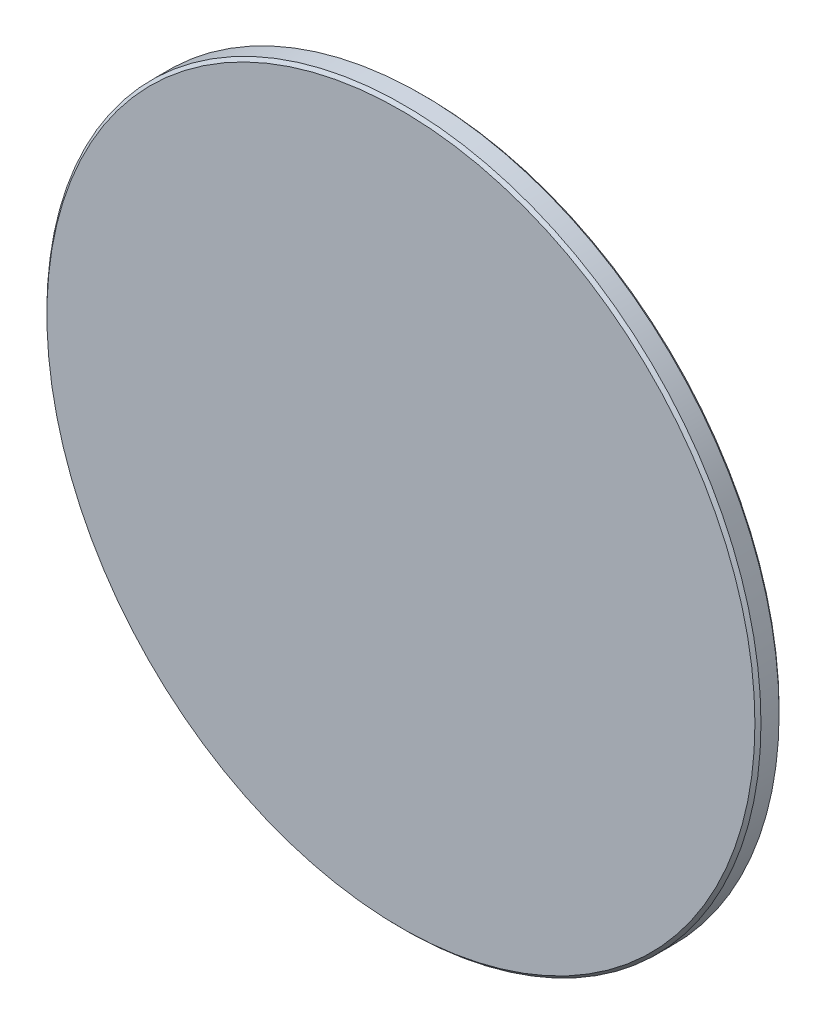
ISO-10303-21;
HEADER;
FILE_DESCRIPTION(('STEP AP214'),'2;1');
FILE_NAME('part.step','',(''),(''),'','','');
FILE_SCHEMA(('AUTOMOTIVE_DESIGN { 1 0 10303 214 1 1 1 1 }'));
ENDSEC;
DATA;
#1=APPLICATION_CONTEXT('core data for automotive mechanical design processes');
#2=APPLICATION_PROTOCOL_DEFINITION('international standard','automotive_design',2000,#1);
#3=PRODUCT_CONTEXT('',#1,'mechanical');
#4=PRODUCT('Part','Part','',(#3));
#5=PRODUCT_RELATED_PRODUCT_CATEGORY('part','',(#4));
#6=PRODUCT_DEFINITION_FORMATION('','',#4);
#7=PRODUCT_DEFINITION_CONTEXT('part definition',#1,'design');
#8=PRODUCT_DEFINITION('design','',#6,#7);
#9=PRODUCT_DEFINITION_SHAPE('','',#8);
#10=(LENGTH_UNIT() NAMED_UNIT(*) SI_UNIT(.MILLI.,.METRE.));
#11=(NAMED_UNIT(*) PLANE_ANGLE_UNIT() SI_UNIT($,.RADIAN.));
#12=(NAMED_UNIT(*) SI_UNIT($,.STERADIAN.) SOLID_ANGLE_UNIT());
#13=UNCERTAINTY_MEASURE_WITH_UNIT(LENGTH_MEASURE(1.E-05),#10,'distance_accuracy_value','');
#14=(GEOMETRIC_REPRESENTATION_CONTEXT(3) GLOBAL_UNCERTAINTY_ASSIGNED_CONTEXT((#13)) GLOBAL_UNIT_ASSIGNED_CONTEXT((#10,
#11,#12)) REPRESENTATION_CONTEXT('',''));
#15=CARTESIAN_POINT('',(0.,0.,0.));
#16=DIRECTION('',(0.,0.,1.));
#17=DIRECTION('',(1.,0.,0.));
#18=AXIS2_PLACEMENT_3D('',#15,#16,#17);
#19=CARTESIAN_POINT('',(0.,0.,4.));
#20=DIRECTION('',(0.,0.,-1.));
#21=DIRECTION('',(-1.,0.,0.));
#22=AXIS2_PLACEMENT_3D('',#19,#20,#21);
#23=CYLINDRICAL_SURFACE('',#22,59.);
#24=CARTESIAN_POINT('',(0.,0.,0.5));
#25=DIRECTION('',(0.,0.,1.));
#26=DIRECTION('',(1.,0.,0.));
#27=AXIS2_PLACEMENT_3D('',#24,#25,#26);
#28=CIRCLE('',#27,59.);
#29=CARTESIAN_POINT('',(59.,0.,0.5));
#30=VERTEX_POINT('',#29);
#31=EDGE_CURVE('E48',#30,#30,#28,.T.);
#32=ORIENTED_EDGE('',*,*,#31,.T.);
#33=EDGE_LOOP('',(#32));
#34=FACE_BOUND('',#33,.T.);
#35=CARTESIAN_POINT('',(0.,0.,3.49999999999999));
#36=DIRECTION('',(0.,0.,1.));
#37=DIRECTION('',(1.,0.,0.));
#38=AXIS2_PLACEMENT_3D('',#35,#36,#37);
#39=CIRCLE('',#38,59.);
#40=CARTESIAN_POINT('',(59.,0.,3.49999999999999));
#41=VERTEX_POINT('',#40);
#42=EDGE_CURVE('E52',#41,#41,#39,.F.);
#43=ORIENTED_EDGE('',*,*,#42,.T.);
#44=EDGE_LOOP('',(#43));
#45=FACE_BOUND('',#44,.T.);
#46=ADVANCED_FACE('F36',(#34,#45),#23,.T.);
#47=CARTESIAN_POINT('',(0.,0.,4.));
#48=DIRECTION('',(0.,0.,1.));
#49=DIRECTION('',(1.,0.,0.));
#50=AXIS2_PLACEMENT_3D('',#47,#48,#49);
#51=PLANE('',#50);
#52=CARTESIAN_POINT('',(0.,0.,4.));
#53=DIRECTION('',(0.,0.,1.));
#54=DIRECTION('',(1.,0.,0.));
#55=AXIS2_PLACEMENT_3D('',#52,#53,#54);
#56=CIRCLE('',#55,58.5);
#57=CARTESIAN_POINT('',(58.5,0.,4.));
#58=VERTEX_POINT('',#57);
#59=EDGE_CURVE('E10',#58,#58,#56,.T.);
#60=ORIENTED_EDGE('',*,*,#59,.T.);
#61=EDGE_LOOP('',(#60));
#62=FACE_BOUND('',#61,.T.);
#63=ADVANCED_FACE('F68',(#62),#51,.T.);
#64=CARTESIAN_POINT('',(0.,0.,0.));
#65=DIRECTION('',(0.,0.,1.));
#66=DIRECTION('',(1.,0.,0.));
#67=AXIS2_PLACEMENT_3D('',#64,#65,#66);
#68=PLANE('',#67);
#69=CARTESIAN_POINT('',(0.,0.,0.));
#70=DIRECTION('',(0.,0.,1.));
#71=DIRECTION('',(1.,0.,0.));
#72=AXIS2_PLACEMENT_3D('',#69,#70,#71);
#73=CIRCLE('',#72,58.5);
#74=CARTESIAN_POINT('',(58.5,0.,0.));
#75=VERTEX_POINT('',#74);
#76=EDGE_CURVE('E44',#75,#75,#73,.F.);
#77=ORIENTED_EDGE('',*,*,#76,.T.);
#78=EDGE_LOOP('',(#77));
#79=FACE_BOUND('',#78,.T.);
#80=ADVANCED_FACE('F65',(#79),#68,.F.);
#81=CARTESIAN_POINT('',(0.,0.,0.5));
#82=DIRECTION('',(0.,0.,1.));
#83=DIRECTION('',(1.,0.,0.));
#84=AXIS2_PLACEMENT_3D('',#81,#82,#83);
#85=CONICAL_SURFACE('',#84,59.,0.785398163397448);
#86=ORIENTED_EDGE('',*,*,#76,.F.);
#87=EDGE_LOOP('',(#86));
#88=FACE_BOUND('',#87,.T.);
#89=ORIENTED_EDGE('',*,*,#31,.F.);
#90=EDGE_LOOP('',(#89));
#91=FACE_BOUND('',#90,.T.);
#92=ADVANCED_FACE('F61',(#88,#91),#85,.T.);
#93=CARTESIAN_POINT('',(0.,0.,4.));
#94=DIRECTION('',(0.,0.,-1.));
#95=DIRECTION('',(-1.,0.,0.));
#96=AXIS2_PLACEMENT_3D('',#93,#94,#95);
#97=CONICAL_SURFACE('',#96,58.5,0.785398163397448);
#98=ORIENTED_EDGE('',*,*,#42,.F.);
#99=EDGE_LOOP('',(#98));
#100=FACE_BOUND('',#99,.T.);
#101=ORIENTED_EDGE('',*,*,#59,.F.);
#102=EDGE_LOOP('',(#101));
#103=FACE_BOUND('',#102,.T.);
#104=ADVANCED_FACE('F39',(#100,#103),#97,.T.);
#105=CLOSED_SHELL('',(#46,#63,#80,#92,#104));
#106=MANIFOLD_SOLID_BREP('B2',#105);
#107=ADVANCED_BREP_SHAPE_REPRESENTATION('',(#18,#106),#14);
#108=SHAPE_DEFINITION_REPRESENTATION(#9,#107);
ENDSEC;
END-ISO-10303-21;
